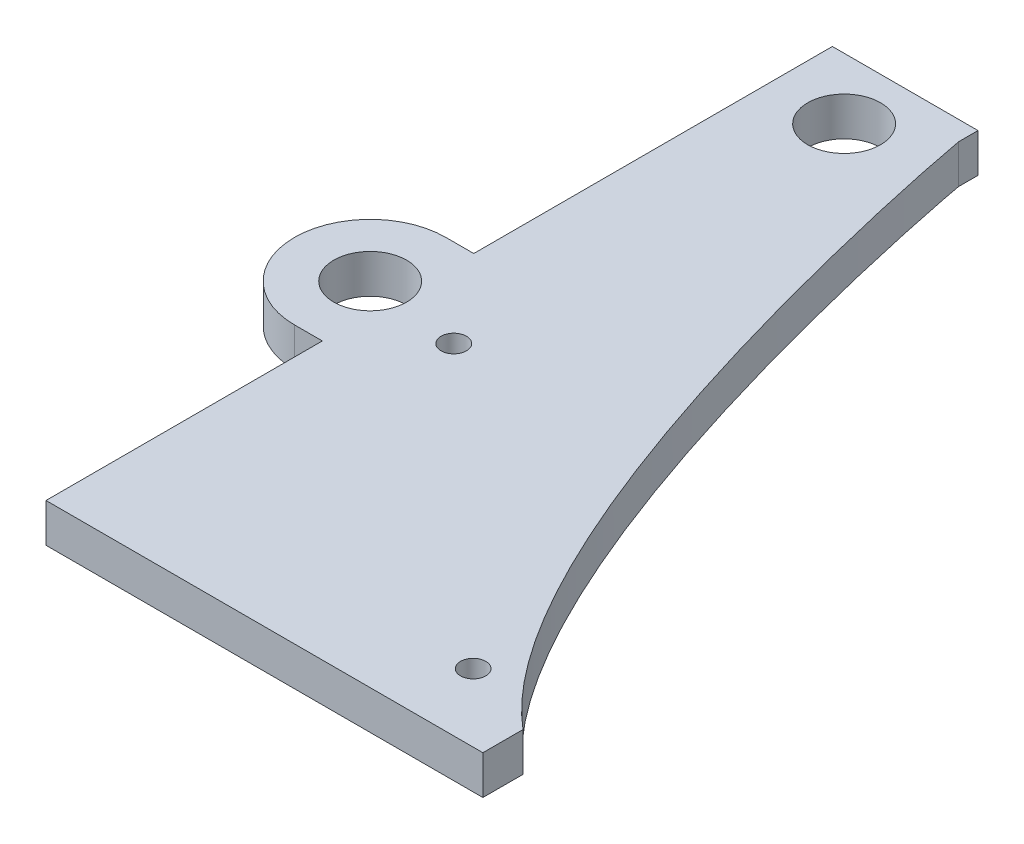
ISO-10303-21;
HEADER;
FILE_DESCRIPTION(('STEP AP214'),'2;1');
FILE_NAME('part.step','',(''),(''),'','','');
FILE_SCHEMA(('AUTOMOTIVE_DESIGN { 1 0 10303 214 1 1 1 1 }'));
ENDSEC;
DATA;
#1=APPLICATION_CONTEXT('core data for automotive mechanical design processes');
#2=APPLICATION_PROTOCOL_DEFINITION('international standard','automotive_design',2000,#1);
#3=PRODUCT_CONTEXT('',#1,'mechanical');
#4=PRODUCT('Part','Part','',(#3));
#5=PRODUCT_RELATED_PRODUCT_CATEGORY('part','',(#4));
#6=PRODUCT_DEFINITION_FORMATION('','',#4);
#7=PRODUCT_DEFINITION_CONTEXT('part definition',#1,'design');
#8=PRODUCT_DEFINITION('design','',#6,#7);
#9=PRODUCT_DEFINITION_SHAPE('','',#8);
#10=(LENGTH_UNIT() NAMED_UNIT(*) SI_UNIT(.MILLI.,.METRE.));
#11=(NAMED_UNIT(*) PLANE_ANGLE_UNIT() SI_UNIT($,.RADIAN.));
#12=(NAMED_UNIT(*) SI_UNIT($,.STERADIAN.) SOLID_ANGLE_UNIT());
#13=UNCERTAINTY_MEASURE_WITH_UNIT(LENGTH_MEASURE(1.E-05),#10,'distance_accuracy_value','');
#14=(GEOMETRIC_REPRESENTATION_CONTEXT(3) GLOBAL_UNCERTAINTY_ASSIGNED_CONTEXT((#13)) GLOBAL_UNIT_ASSIGNED_CONTEXT((#10,
#11,#12)) REPRESENTATION_CONTEXT('',''));
#15=CARTESIAN_POINT('',(0.,0.,0.));
#16=DIRECTION('',(0.,0.,1.));
#17=DIRECTION('',(1.,0.,0.));
#18=AXIS2_PLACEMENT_3D('',#15,#16,#17);
#19=CARTESIAN_POINT('',(-9.525,5.08,48.8950000000001));
#20=DIRECTION('',(1.,0.,0.));
#21=DIRECTION('',(0.,0.,-1.));
#22=AXIS2_PLACEMENT_3D('',#19,#20,#21);
#23=PLANE('',#22);
#24=DIRECTION('',(0.,0.,1.));
#25=VECTOR('',#24,1.);
#26=CARTESIAN_POINT('',(-9.525,5.08,48.8950000000001));
#27=LINE('',#26,#25);
#28=CARTESIAN_POINT('',(-9.52499999999999,5.08,12.74826));
#29=VERTEX_POINT('',#28);
#30=CARTESIAN_POINT('',(-9.525,5.08,48.8950000000001));
#31=VERTEX_POINT('',#30);
#32=EDGE_CURVE('E63',#29,#31,#27,.T.);
#33=ORIENTED_EDGE('',*,*,#32,.F.);
#34=DIRECTION('',(0.,-1.,0.));
#35=VECTOR('',#34,1.);
#36=CARTESIAN_POINT('',(-9.52499999999998,5.08,12.74826));
#37=LINE('',#36,#35);
#38=CARTESIAN_POINT('',(-9.52499999999999,0.,12.74826));
#39=VERTEX_POINT('',#38);
#40=EDGE_CURVE('E215',#29,#39,#37,.T.);
#41=ORIENTED_EDGE('',*,*,#40,.T.);
#42=DIRECTION('',(0.,0.,1.));
#43=VECTOR('',#42,1.);
#44=CARTESIAN_POINT('',(-9.525,0.,48.8950000000001));
#45=LINE('',#44,#43);
#46=CARTESIAN_POINT('',(-9.525,0.,48.8950000000001));
#47=VERTEX_POINT('',#46);
#48=EDGE_CURVE('E142',#39,#47,#45,.T.);
#49=ORIENTED_EDGE('',*,*,#48,.T.);
#50=DIRECTION('',(0.,-1.,0.));
#51=VECTOR('',#50,1.);
#52=CARTESIAN_POINT('',(-9.525,5.08,48.8950000000001));
#53=LINE('',#52,#51);
#54=EDGE_CURVE('E138',#31,#47,#53,.T.);
#55=ORIENTED_EDGE('',*,*,#54,.F.);
#56=EDGE_LOOP('',(#33,#41,#49,#55));
#57=FACE_BOUND('',#56,.T.);
#58=ADVANCED_FACE('F37',(#57),#23,.F.);
#59=CARTESIAN_POINT('',(22.7352910938507,5.08,-1.18732961513015));
#60=DIRECTION('',(0.,-1.,0.));
#61=DIRECTION('',(0.,0.,-1.));
#62=AXIS2_PLACEMENT_3D('',#59,#60,#61);
#63=PLANE('',#62);
#64=DIRECTION('',(1.,0.,0.));
#65=VECTOR('',#64,1.);
#66=CARTESIAN_POINT('',(60.325,5.08,48.8950000000001));
#67=LINE('',#66,#65);
#68=CARTESIAN_POINT('',(47.625,5.08,48.8950000000001));
#69=VERTEX_POINT('',#68);
#70=EDGE_CURVE('E314',#31,#69,#67,.T.);
#71=ORIENTED_EDGE('',*,*,#70,.T.);
#72=DIRECTION('',(0.,0.,-1.));
#73=VECTOR('',#72,1.);
#74=CARTESIAN_POINT('',(47.6249999999996,5.08,-1.18732961513035));
#75=LINE('',#74,#73);
#76=CARTESIAN_POINT('',(47.6250000000699,5.08000259900955,43.6465020542731));
#77=VERTEX_POINT('',#76);
#78=EDGE_CURVE('E118',#69,#77,#75,.T.);
#79=ORIENTED_EDGE('',*,*,#78,.T.);
#80=CARTESIAN_POINT('',(9.525,5.08,-51.435));
#81=CARTESIAN_POINT('',(9.525,5.08,-51.245136562547));
#82=CARTESIAN_POINT('',(23.0942727348183,5.08,23.0353688177004));
#83=CARTESIAN_POINT('',(47.6250083703796,5.08,43.646493859002));
#84=B_SPLINE_CURVE_WITH_KNOTS('',3,(#80,#81,#82,#83),.UNSPECIFIED.,.F.,.F.,(4,4),
(0.138763063012901,1.),.UNSPECIFIED.);
#85=CARTESIAN_POINT('',(9.525,5.08,-51.435));
#86=VERTEX_POINT('',#85);
#87=EDGE_CURVE('E252',#77,#86,#84,.F.);
#88=ORIENTED_EDGE('',*,*,#87,.T.);
#89=DIRECTION('',(0.,0.,-1.));
#90=VECTOR('',#89,1.);
#91=CARTESIAN_POINT('',(9.525,5.08,-51.435));
#92=LINE('',#91,#90);
#93=CARTESIAN_POINT('',(9.52499999999999,5.08,-53.9749999999999));
#94=VERTEX_POINT('',#93);
#95=EDGE_CURVE('E141',#86,#94,#92,.T.);
#96=ORIENTED_EDGE('',*,*,#95,.T.);
#97=DIRECTION('',(-1.,0.,0.));
#98=VECTOR('',#97,1.);
#99=CARTESIAN_POINT('',(-9.52499999999998,5.08,-53.9749999999999));
#100=LINE('',#99,#98);
#101=CARTESIAN_POINT('',(-9.52499999999998,5.08,-53.9749999999999));
#102=VERTEX_POINT('',#101);
#103=EDGE_CURVE('E238',#94,#102,#100,.T.);
#104=ORIENTED_EDGE('',*,*,#103,.T.);
#105=CARTESIAN_POINT('',(-9.52499999999999,5.08,-7.06373999999996));
#106=VERTEX_POINT('',#105);
#107=EDGE_CURVE('E178',#102,#106,#27,.T.);
#108=ORIENTED_EDGE('',*,*,#107,.T.);
#109=DIRECTION('',(1.,0.,0.));
#110=VECTOR('',#109,1.);
#111=CARTESIAN_POINT('',(-13.170662,5.08,-7.06373999999996));
#112=LINE('',#111,#110);
#113=CARTESIAN_POINT('',(-13.170662,5.08,-7.06373999999996));
#114=VERTEX_POINT('',#113);
#115=EDGE_CURVE('E319',#114,#106,#112,.T.);
#116=ORIENTED_EDGE('',*,*,#115,.F.);
#117=CARTESIAN_POINT('',(-13.170662,5.08,2.84226000000004));
#118=DIRECTION('',(0.,-1.,0.));
#119=DIRECTION('',(0.,0.,-1.));
#120=AXIS2_PLACEMENT_3D('',#117,#118,#119);
#121=CIRCLE('',#120,9.906);
#122=CARTESIAN_POINT('',(-13.170662,5.08,12.74826));
#123=VERTEX_POINT('',#122);
#124=EDGE_CURVE('E206',#123,#114,#121,.T.);
#125=ORIENTED_EDGE('',*,*,#124,.F.);
#126=DIRECTION('',(-1.,0.,0.));
#127=VECTOR('',#126,1.);
#128=CARTESIAN_POINT('',(-13.170662,5.08,12.74826));
#129=LINE('',#128,#127);
#130=EDGE_CURVE('E221',#29,#123,#129,.T.);
#131=ORIENTED_EDGE('',*,*,#130,.F.);
#132=ORIENTED_EDGE('',*,*,#32,.T.);
#133=EDGE_LOOP('',(#71,#79,#88,#96,#104,#108,#116,#125,#131,#132));
#134=FACE_BOUND('',#133,.T.);
#135=CARTESIAN_POINT('',(-0.635000000000004,5.08,4.44500000000005));
#136=DIRECTION('',(0.,-1.,0.));
#137=DIRECTION('',(0.,0.,-1.));
#138=AXIS2_PLACEMENT_3D('',#135,#136,#137);
#139=CIRCLE('',#138,1.66072838208594);
#140=CARTESIAN_POINT('',(-0.635000000000004,5.08,2.78427161791411));
#141=VERTEX_POINT('',#140);
#142=EDGE_CURVE('E222',#141,#141,#139,.T.);
#143=ORIENTED_EDGE('',*,*,#142,.T.);
#144=EDGE_LOOP('',(#143));
#145=FACE_BOUND('',#144,.T.);
#146=CARTESIAN_POINT('',(37.465,5.08,40.0050000000001));
#147=DIRECTION('',(0.,-1.,0.));
#148=DIRECTION('',(0.,0.,-1.));
#149=AXIS2_PLACEMENT_3D('',#146,#147,#148);
#150=CIRCLE('',#149,1.651);
#151=CARTESIAN_POINT('',(37.465,5.08,38.3540000000001));
#152=VERTEX_POINT('',#151);
#153=EDGE_CURVE('E214',#152,#152,#150,.T.);
#154=ORIENTED_EDGE('',*,*,#153,.T.);
#155=EDGE_LOOP('',(#154));
#156=FACE_BOUND('',#155,.T.);
#157=CARTESIAN_POINT('',(-13.170662,5.08,2.84226000000004));
#158=DIRECTION('',(0.,-1.,0.));
#159=DIRECTION('',(0.,0.,-1.));
#160=AXIS2_PLACEMENT_3D('',#157,#158,#159);
#161=CIRCLE('',#160,4.7625);
#162=CARTESIAN_POINT('',(-13.170662,5.08,-1.92023999999995));
#163=VERTEX_POINT('',#162);
#164=EDGE_CURVE('E208',#163,#163,#161,.T.);
#165=ORIENTED_EDGE('',*,*,#164,.T.);
#166=EDGE_LOOP('',(#165));
#167=FACE_BOUND('',#166,.T.);
#168=CARTESIAN_POINT('',(0.,5.08,-45.9866999999999));
#169=DIRECTION('',(0.,1.,0.));
#170=DIRECTION('',(0.,0.,1.));
#171=AXIS2_PLACEMENT_3D('',#168,#169,#170);
#172=CIRCLE('',#171,4.7625);
#173=CARTESIAN_POINT('',(0.,5.08,-41.2241999999999));
#174=VERTEX_POINT('',#173);
#175=EDGE_CURVE('E234',#174,#174,#172,.T.);
#176=ORIENTED_EDGE('',*,*,#175,.F.);
#177=EDGE_LOOP('',(#176));
#178=FACE_BOUND('',#177,.T.);
#179=ADVANCED_FACE('F260',(#134,#145,#156,#167,#178),#63,.F.);
#180=CARTESIAN_POINT('',(22.7352910938507,0.,-1.18732961513015));
#181=DIRECTION('',(0.,-1.,0.));
#182=DIRECTION('',(0.,0.,-1.));
#183=AXIS2_PLACEMENT_3D('',#180,#181,#182);
#184=PLANE('',#183);
#185=DIRECTION('',(0.,0.,-1.));
#186=VECTOR('',#185,1.);
#187=CARTESIAN_POINT('',(47.625,0.,43.6464868260698));
#188=LINE('',#187,#186);
#189=CARTESIAN_POINT('',(47.625,0.,48.8950000000001));
#190=VERTEX_POINT('',#189);
#191=CARTESIAN_POINT('',(47.6249996337158,0.,43.646487262033));
#192=VERTEX_POINT('',#191);
#193=EDGE_CURVE('E55',#190,#192,#188,.T.);
#194=ORIENTED_EDGE('',*,*,#193,.F.);
#195=DIRECTION('',(1.,0.,0.));
#196=VECTOR('',#195,1.);
#197=CARTESIAN_POINT('',(60.325,0.,48.8950000000001));
#198=LINE('',#197,#196);
#199=EDGE_CURVE('E131',#47,#190,#198,.T.);
#200=ORIENTED_EDGE('',*,*,#199,.F.);
#201=ORIENTED_EDGE('',*,*,#48,.F.);
#202=DIRECTION('',(-1.,0.,0.));
#203=VECTOR('',#202,1.);
#204=CARTESIAN_POINT('',(-13.170662,0.,12.74826));
#205=LINE('',#204,#203);
#206=CARTESIAN_POINT('',(-13.170662,0.,12.74826));
#207=VERTEX_POINT('',#206);
#208=EDGE_CURVE('E204',#39,#207,#205,.T.);
#209=ORIENTED_EDGE('',*,*,#208,.T.);
#210=CARTESIAN_POINT('',(-13.170662,0.,2.84226000000004));
#211=DIRECTION('',(0.,-1.,0.));
#212=DIRECTION('',(0.,0.,-1.));
#213=AXIS2_PLACEMENT_3D('',#210,#211,#212);
#214=CIRCLE('',#213,9.906);
#215=CARTESIAN_POINT('',(-13.170662,0.,-7.06373999999996));
#216=VERTEX_POINT('',#215);
#217=EDGE_CURVE('E202',#207,#216,#214,.T.);
#218=ORIENTED_EDGE('',*,*,#217,.T.);
#219=DIRECTION('',(1.,0.,0.));
#220=VECTOR('',#219,1.);
#221=CARTESIAN_POINT('',(-13.170662,0.,-7.06373999999996));
#222=LINE('',#221,#220);
#223=CARTESIAN_POINT('',(-9.52499999999999,0.,-7.06373999999996));
#224=VERTEX_POINT('',#223);
#225=EDGE_CURVE('E199',#216,#224,#222,.T.);
#226=ORIENTED_EDGE('',*,*,#225,.T.);
#227=CARTESIAN_POINT('',(-9.52499999999998,0.,-53.9749999999999));
#228=VERTEX_POINT('',#227);
#229=EDGE_CURVE('E139',#228,#224,#45,.T.);
#230=ORIENTED_EDGE('',*,*,#229,.F.);
#231=DIRECTION('',(-1.,0.,0.));
#232=VECTOR('',#231,1.);
#233=CARTESIAN_POINT('',(-9.52499999999998,0.,-53.9749999999999));
#234=LINE('',#233,#232);
#235=CARTESIAN_POINT('',(9.52499999999999,0.,-53.9749999999999));
#236=VERTEX_POINT('',#235);
#237=EDGE_CURVE('E180',#236,#228,#234,.T.);
#238=ORIENTED_EDGE('',*,*,#237,.F.);
#239=DIRECTION('',(0.,0.,-1.));
#240=VECTOR('',#239,1.);
#241=CARTESIAN_POINT('',(9.525,0.,-51.435));
#242=LINE('',#241,#240);
#243=CARTESIAN_POINT('',(9.525,0.,-51.435));
#244=VERTEX_POINT('',#243);
#245=EDGE_CURVE('E184',#244,#236,#242,.T.);
#246=ORIENTED_EDGE('',*,*,#245,.F.);
#247=CARTESIAN_POINT('',(47.6250000000057,0.,43.6464868260746));
#248=CARTESIAN_POINT('',(23.0942696480815,0.,23.0353519203787));
#249=CARTESIAN_POINT('',(9.525,0.,-51.2451365841421));
#250=CARTESIAN_POINT('',(9.525,0.,-51.435));
#251=B_SPLINE_CURVE_WITH_KNOTS('',3,(#247,#248,#249,#250),.UNSPECIFIED.,.F.,.F.,(4,4),
(0.138763160969952,1.),.UNSPECIFIED.);
#252=EDGE_CURVE('E133',#192,#244,#251,.T.);
#253=ORIENTED_EDGE('',*,*,#252,.F.);
#254=EDGE_LOOP('',(#194,#200,#201,#209,#218,#226,#230,#238,#246,#253));
#255=FACE_BOUND('',#254,.T.);
#256=CARTESIAN_POINT('',(-13.170662,0.,2.84226000000004));
#257=DIRECTION('',(0.,-1.,0.));
#258=DIRECTION('',(0.,0.,-1.));
#259=AXIS2_PLACEMENT_3D('',#256,#257,#258);
#260=CIRCLE('',#259,4.7625);
#261=CARTESIAN_POINT('',(-13.170662,0.,-1.92023999999995));
#262=VERTEX_POINT('',#261);
#263=EDGE_CURVE('E325',#262,#262,#260,.T.);
#264=ORIENTED_EDGE('',*,*,#263,.F.);
#265=EDGE_LOOP('',(#264));
#266=FACE_BOUND('',#265,.T.);
#267=CARTESIAN_POINT('',(-0.635000000000004,0.,4.44500000000005));
#268=DIRECTION('',(0.,-1.,0.));
#269=DIRECTION('',(0.,0.,-1.));
#270=AXIS2_PLACEMENT_3D('',#267,#268,#269);
#271=CIRCLE('',#270,1.66072838208594);
#272=CARTESIAN_POINT('',(-0.635000000000004,0.,2.78427161791411));
#273=VERTEX_POINT('',#272);
#274=EDGE_CURVE('E226',#273,#273,#271,.T.);
#275=ORIENTED_EDGE('',*,*,#274,.F.);
#276=EDGE_LOOP('',(#275));
#277=FACE_BOUND('',#276,.T.);
#278=CARTESIAN_POINT('',(37.465,0.,40.0050000000001));
#279=DIRECTION('',(0.,-1.,0.));
#280=DIRECTION('',(0.,0.,-1.));
#281=AXIS2_PLACEMENT_3D('',#278,#279,#280);
#282=CIRCLE('',#281,1.651);
#283=CARTESIAN_POINT('',(37.465,0.,38.3540000000001));
#284=VERTEX_POINT('',#283);
#285=EDGE_CURVE('E229',#284,#284,#282,.T.);
#286=ORIENTED_EDGE('',*,*,#285,.F.);
#287=EDGE_LOOP('',(#286));
#288=FACE_BOUND('',#287,.T.);
#289=CARTESIAN_POINT('',(0.,0.,-45.9866999999999));
#290=DIRECTION('',(0.,1.,0.));
#291=DIRECTION('',(0.,0.,1.));
#292=AXIS2_PLACEMENT_3D('',#289,#290,#291);
#293=CIRCLE('',#292,4.7625);
#294=CARTESIAN_POINT('',(0.,0.,-41.2241999999999));
#295=VERTEX_POINT('',#294);
#296=EDGE_CURVE('E225',#295,#295,#293,.T.);
#297=ORIENTED_EDGE('',*,*,#296,.T.);
#298=EDGE_LOOP('',(#297));
#299=FACE_BOUND('',#298,.T.);
#300=ADVANCED_FACE('F128',(#255,#266,#277,#288,#299),#184,.T.);
#301=CARTESIAN_POINT('',(9.525,5.08,-51.435));
#302=DIRECTION('',(-1.,0.,0.));
#303=DIRECTION('',(0.,0.,1.));
#304=AXIS2_PLACEMENT_3D('',#301,#302,#303);
#305=PLANE('',#304);
#306=ORIENTED_EDGE('',*,*,#245,.T.);
#307=DIRECTION('',(0.,-1.,0.));
#308=VECTOR('',#307,1.);
#309=CARTESIAN_POINT('',(9.52499999999999,5.08,-53.9749999999999));
#310=LINE('',#309,#308);
#311=EDGE_CURVE('E11',#94,#236,#310,.T.);
#312=ORIENTED_EDGE('',*,*,#311,.F.);
#313=ORIENTED_EDGE('',*,*,#95,.F.);
#314=DIRECTION('',(0.,-1.,0.));
#315=VECTOR('',#314,1.);
#316=CARTESIAN_POINT('',(9.525,5.08,-51.435));
#317=LINE('',#316,#315);
#318=EDGE_CURVE('E186',#86,#244,#317,.T.);
#319=ORIENTED_EDGE('',*,*,#318,.T.);
#320=EDGE_LOOP('',(#306,#312,#313,#319));
#321=FACE_BOUND('',#320,.T.);
#322=ADVANCED_FACE('F39',(#321),#305,.F.);
#323=CARTESIAN_POINT('',(-9.52499999999998,5.08,-53.9749999999999));
#324=DIRECTION('',(0.,0.,1.));
#325=DIRECTION('',(1.,0.,0.));
#326=AXIS2_PLACEMENT_3D('',#323,#324,#325);
#327=PLANE('',#326);
#328=ORIENTED_EDGE('',*,*,#237,.T.);
#329=DIRECTION('',(0.,-1.,0.));
#330=VECTOR('',#329,1.);
#331=CARTESIAN_POINT('',(-9.52499999999998,5.08,-53.9749999999999));
#332=LINE('',#331,#330);
#333=EDGE_CURVE('E47',#102,#228,#332,.T.);
#334=ORIENTED_EDGE('',*,*,#333,.F.);
#335=ORIENTED_EDGE('',*,*,#103,.F.);
#336=ORIENTED_EDGE('',*,*,#311,.T.);
#337=EDGE_LOOP('',(#328,#334,#335,#336));
#338=FACE_BOUND('',#337,.T.);
#339=ADVANCED_FACE('F302',(#338),#327,.F.);
#340=ORIENTED_EDGE('',*,*,#229,.T.);
#341=DIRECTION('',(0.,-1.,0.));
#342=VECTOR('',#341,1.);
#343=CARTESIAN_POINT('',(-9.52499999999998,5.08,-7.06373999999996));
#344=LINE('',#343,#342);
#345=EDGE_CURVE('E217',#106,#224,#344,.T.);
#346=ORIENTED_EDGE('',*,*,#345,.F.);
#347=ORIENTED_EDGE('',*,*,#107,.F.);
#348=ORIENTED_EDGE('',*,*,#333,.T.);
#349=EDGE_LOOP('',(#340,#346,#347,#348));
#350=FACE_BOUND('',#349,.T.);
#351=ADVANCED_FACE('F192',(#350),#23,.F.);
#352=CARTESIAN_POINT('',(60.325,5.08,48.8950000000001));
#353=DIRECTION('',(0.,0.,-1.));
#354=DIRECTION('',(-1.,0.,0.));
#355=AXIS2_PLACEMENT_3D('',#352,#353,#354);
#356=PLANE('',#355);
#357=ORIENTED_EDGE('',*,*,#199,.T.);
#358=DIRECTION('',(0.,-1.,0.));
#359=VECTOR('',#358,1.);
#360=CARTESIAN_POINT('',(47.625,5.080025,48.8950000000001));
#361=LINE('',#360,#359);
#362=EDGE_CURVE('E115',#69,#190,#361,.T.);
#363=ORIENTED_EDGE('',*,*,#362,.F.);
#364=ORIENTED_EDGE('',*,*,#70,.F.);
#365=ORIENTED_EDGE('',*,*,#54,.T.);
#366=EDGE_LOOP('',(#357,#363,#364,#365));
#367=FACE_BOUND('',#366,.T.);
#368=ADVANCED_FACE('F137',(#367),#356,.F.);
#369=CARTESIAN_POINT('',(60.325,5.08,48.895));
#370=CARTESIAN_POINT('',(27.8191095836019,5.08,48.895));
#371=CARTESIAN_POINT('',(9.525,5.08,-51.214545640347));
#372=CARTESIAN_POINT('',(9.525,5.08,-51.435));
#373=B_SPLINE_CURVE_WITH_KNOTS('',3,(#369,#370,#371,#372),.UNSPECIFIED.,.F.,.F.,(4,4),(0.,1.),.UNSPECIFIED.);
#374=DIRECTION('',(0.,-1.,0.));
#375=VECTOR('',#374,1.);
#376=SURFACE_OF_LINEAR_EXTRUSION('',#373,#375);
#377=ORIENTED_EDGE('',*,*,#87,.F.);
#378=DIRECTION('',(0.,-1.,0.));
#379=VECTOR('',#378,1.);
#380=CARTESIAN_POINT('',(47.625,2.5400125,43.6464868260698));
#381=LINE('',#380,#379);
#382=EDGE_CURVE('E123',#77,#192,#381,.T.);
#383=ORIENTED_EDGE('',*,*,#382,.T.);
#384=ORIENTED_EDGE('',*,*,#252,.T.);
#385=ORIENTED_EDGE('',*,*,#318,.F.);
#386=EDGE_LOOP('',(#377,#383,#384,#385));
#387=FACE_BOUND('',#386,.T.);
#388=ADVANCED_FACE('F157',(#387),#376,.F.);
#389=CARTESIAN_POINT('',(0.,5.08,-45.9866999999999));
#390=DIRECTION('',(0.,-1.,0.));
#391=DIRECTION('',(0.,0.,-1.));
#392=AXIS2_PLACEMENT_3D('',#389,#390,#391);
#393=CYLINDRICAL_SURFACE('',#392,4.7625);
#394=ORIENTED_EDGE('',*,*,#175,.T.);
#395=EDGE_LOOP('',(#394));
#396=FACE_BOUND('',#395,.T.);
#397=ORIENTED_EDGE('',*,*,#296,.F.);
#398=EDGE_LOOP('',(#397));
#399=FACE_BOUND('',#398,.T.);
#400=ADVANCED_FACE('F167',(#396,#399),#393,.F.);
#401=CARTESIAN_POINT('',(37.465,5.08,40.0050000000001));
#402=DIRECTION('',(0.,-1.,0.));
#403=DIRECTION('',(0.,0.,-1.));
#404=AXIS2_PLACEMENT_3D('',#401,#402,#403);
#405=CYLINDRICAL_SURFACE('',#404,1.651);
#406=ORIENTED_EDGE('',*,*,#153,.F.);
#407=EDGE_LOOP('',(#406));
#408=FACE_BOUND('',#407,.T.);
#409=ORIENTED_EDGE('',*,*,#285,.T.);
#410=EDGE_LOOP('',(#409));
#411=FACE_BOUND('',#410,.T.);
#412=ADVANCED_FACE('F271',(#408,#411),#405,.F.);
#413=CARTESIAN_POINT('',(-0.635000000000004,5.08,4.44500000000005));
#414=DIRECTION('',(0.,-1.,0.));
#415=DIRECTION('',(0.,0.,-1.));
#416=AXIS2_PLACEMENT_3D('',#413,#414,#415);
#417=CYLINDRICAL_SURFACE('',#416,1.66072838208594);
#418=ORIENTED_EDGE('',*,*,#142,.F.);
#419=EDGE_LOOP('',(#418));
#420=FACE_BOUND('',#419,.T.);
#421=ORIENTED_EDGE('',*,*,#274,.T.);
#422=EDGE_LOOP('',(#421));
#423=FACE_BOUND('',#422,.T.);
#424=ADVANCED_FACE('F275',(#420,#423),#417,.F.);
#425=CARTESIAN_POINT('',(-13.170662,5.08,2.84226000000004));
#426=DIRECTION('',(0.,-1.,0.));
#427=DIRECTION('',(0.,0.,-1.));
#428=AXIS2_PLACEMENT_3D('',#425,#426,#427);
#429=CYLINDRICAL_SURFACE('',#428,4.7625);
#430=ORIENTED_EDGE('',*,*,#164,.F.);
#431=EDGE_LOOP('',(#430));
#432=FACE_BOUND('',#431,.T.);
#433=ORIENTED_EDGE('',*,*,#263,.T.);
#434=EDGE_LOOP('',(#433));
#435=FACE_BOUND('',#434,.T.);
#436=ADVANCED_FACE('F279',(#432,#435),#429,.F.);
#437=CARTESIAN_POINT('',(-13.170662,5.08,2.84226000000004));
#438=DIRECTION('',(0.,-1.,0.));
#439=DIRECTION('',(0.,0.,-1.));
#440=AXIS2_PLACEMENT_3D('',#437,#438,#439);
#441=CYLINDRICAL_SURFACE('',#440,9.906);
#442=ORIENTED_EDGE('',*,*,#217,.F.);
#443=DIRECTION('',(0.,-1.,0.));
#444=VECTOR('',#443,1.);
#445=CARTESIAN_POINT('',(-13.170662,5.08,12.74826));
#446=LINE('',#445,#444);
#447=EDGE_CURVE('E212',#123,#207,#446,.T.);
#448=ORIENTED_EDGE('',*,*,#447,.F.);
#449=ORIENTED_EDGE('',*,*,#124,.T.);
#450=DIRECTION('',(0.,-1.,0.));
#451=VECTOR('',#450,1.);
#452=CARTESIAN_POINT('',(-13.170662,5.08,-7.06373999999996));
#453=LINE('',#452,#451);
#454=EDGE_CURVE('E219',#114,#216,#453,.T.);
#455=ORIENTED_EDGE('',*,*,#454,.T.);
#456=EDGE_LOOP('',(#442,#448,#449,#455));
#457=FACE_BOUND('',#456,.T.);
#458=ADVANCED_FACE('F281',(#457),#441,.T.);
#459=CARTESIAN_POINT('',(-13.170662,5.08,12.74826));
#460=DIRECTION('',(0.,0.,1.));
#461=DIRECTION('',(1.,0.,0.));
#462=AXIS2_PLACEMENT_3D('',#459,#460,#461);
#463=PLANE('',#462);
#464=ORIENTED_EDGE('',*,*,#208,.F.);
#465=ORIENTED_EDGE('',*,*,#40,.F.);
#466=ORIENTED_EDGE('',*,*,#130,.T.);
#467=ORIENTED_EDGE('',*,*,#447,.T.);
#468=EDGE_LOOP('',(#464,#465,#466,#467));
#469=FACE_BOUND('',#468,.T.);
#470=ADVANCED_FACE('F284',(#469),#463,.T.);
#471=CARTESIAN_POINT('',(-13.170662,5.08,-7.06373999999996));
#472=DIRECTION('',(0.,0.,-1.));
#473=DIRECTION('',(-1.,0.,0.));
#474=AXIS2_PLACEMENT_3D('',#471,#472,#473);
#475=PLANE('',#474);
#476=ORIENTED_EDGE('',*,*,#225,.F.);
#477=ORIENTED_EDGE('',*,*,#454,.F.);
#478=ORIENTED_EDGE('',*,*,#115,.T.);
#479=ORIENTED_EDGE('',*,*,#345,.T.);
#480=EDGE_LOOP('',(#476,#477,#478,#479));
#481=FACE_BOUND('',#480,.T.);
#482=ADVANCED_FACE('F286',(#481),#475,.T.);
#483=CARTESIAN_POINT('',(47.625,5.080025,43.6464868260698));
#484=DIRECTION('',(-1.,0.,0.));
#485=DIRECTION('',(0.,0.,1.));
#486=AXIS2_PLACEMENT_3D('',#483,#484,#485);
#487=PLANE('',#486);
#488=ORIENTED_EDGE('',*,*,#362,.T.);
#489=ORIENTED_EDGE('',*,*,#193,.T.);
#490=ORIENTED_EDGE('',*,*,#382,.F.);
#491=ORIENTED_EDGE('',*,*,#78,.F.);
#492=EDGE_LOOP('',(#488,#489,#490,#491));
#493=FACE_BOUND('',#492,.T.);
#494=ADVANCED_FACE('F116',(#493),#487,.F.);
#495=CLOSED_SHELL('',(#58,#179,#300,#322,#339,#351,#368,#388,#400,#412,#424,#436,#458,#470,#482,#494));
#496=MANIFOLD_SOLID_BREP('B2',#495);
#497=ADVANCED_BREP_SHAPE_REPRESENTATION('',(#18,#496),#14);
#498=SHAPE_DEFINITION_REPRESENTATION(#9,#497);
ENDSEC;
END-ISO-10303-21;
